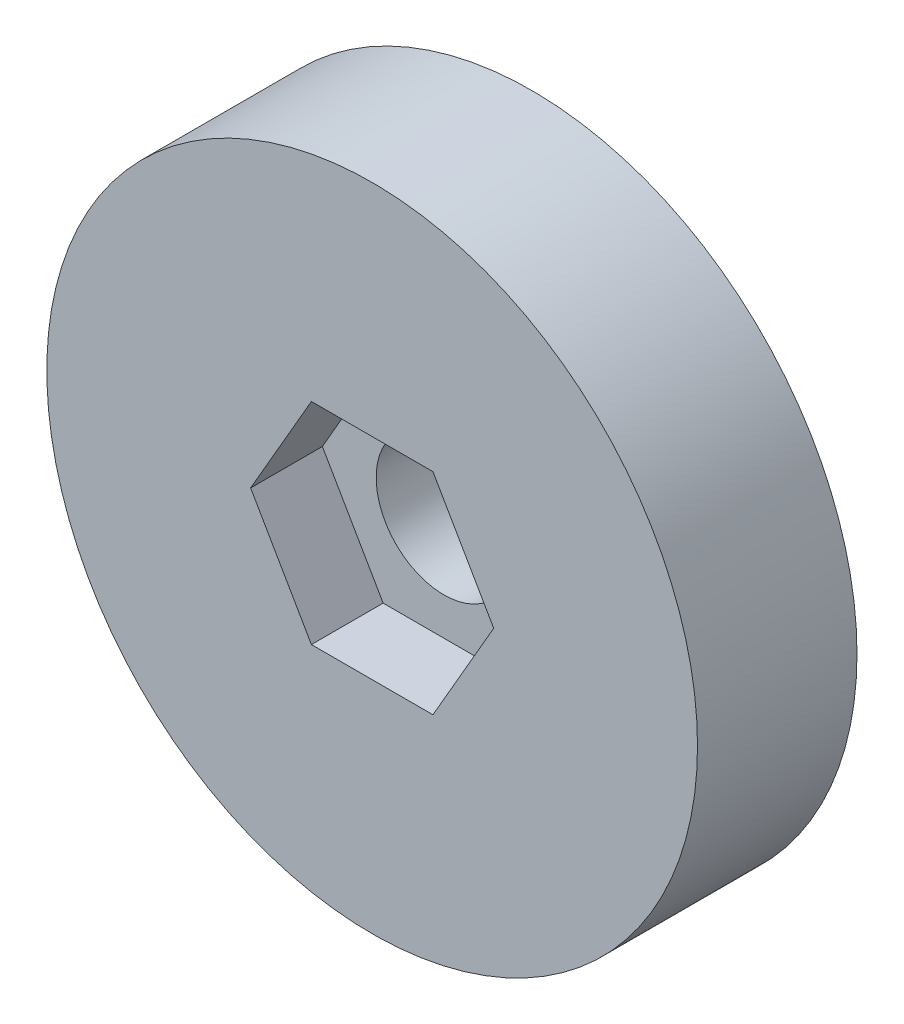
ISO-10303-21;
HEADER;
FILE_DESCRIPTION(('STEP AP214'),'2;1');
FILE_NAME('part.step','',(''),(''),'','','');
FILE_SCHEMA(('AUTOMOTIVE_DESIGN { 1 0 10303 214 1 1 1 1 }'));
ENDSEC;
DATA;
#1=APPLICATION_CONTEXT('core data for automotive mechanical design processes');
#2=APPLICATION_PROTOCOL_DEFINITION('international standard','automotive_design',2000,#1);
#3=PRODUCT_CONTEXT('',#1,'mechanical');
#4=PRODUCT('Part','Part','',(#3));
#5=PRODUCT_RELATED_PRODUCT_CATEGORY('part','',(#4));
#6=PRODUCT_DEFINITION_FORMATION('','',#4);
#7=PRODUCT_DEFINITION_CONTEXT('part definition',#1,'design');
#8=PRODUCT_DEFINITION('design','',#6,#7);
#9=PRODUCT_DEFINITION_SHAPE('','',#8);
#10=(LENGTH_UNIT() NAMED_UNIT(*) SI_UNIT(.MILLI.,.METRE.));
#11=(NAMED_UNIT(*) PLANE_ANGLE_UNIT() SI_UNIT($,.RADIAN.));
#12=(NAMED_UNIT(*) SI_UNIT($,.STERADIAN.) SOLID_ANGLE_UNIT());
#13=UNCERTAINTY_MEASURE_WITH_UNIT(LENGTH_MEASURE(1.E-05),#10,'distance_accuracy_value','');
#14=(GEOMETRIC_REPRESENTATION_CONTEXT(3) GLOBAL_UNCERTAINTY_ASSIGNED_CONTEXT((#13)) GLOBAL_UNIT_ASSIGNED_CONTEXT((#10,
#11,#12)) REPRESENTATION_CONTEXT('',''));
#15=CARTESIAN_POINT('',(0.,0.,0.));
#16=DIRECTION('',(0.,0.,1.));
#17=DIRECTION('',(1.,0.,0.));
#18=AXIS2_PLACEMENT_3D('',#15,#16,#17);
#19=CARTESIAN_POINT('',(0.,0.,10.));
#20=DIRECTION('',(0.,0.,-1.));
#21=DIRECTION('',(-1.,0.,0.));
#22=AXIS2_PLACEMENT_3D('',#19,#20,#21);
#23=CYLINDRICAL_SURFACE('',#22,4.25);
#24=CARTESIAN_POINT('',(0.,0.,0.));
#25=DIRECTION('',(0.,0.,1.));
#26=DIRECTION('',(1.,0.,0.));
#27=AXIS2_PLACEMENT_3D('',#24,#25,#26);
#28=CIRCLE('',#27,4.25);
#29=CARTESIAN_POINT('',(4.25,0.,0.));
#30=VERTEX_POINT('',#29);
#31=EDGE_CURVE('E142',#30,#30,#28,.T.);
#32=ORIENTED_EDGE('',*,*,#31,.F.);
#33=EDGE_LOOP('',(#32));
#34=FACE_BOUND('',#33,.T.);
#35=CARTESIAN_POINT('',(0.,0.,5.5));
#36=DIRECTION('',(0.,0.,1.));
#37=DIRECTION('',(1.,0.,0.));
#38=AXIS2_PLACEMENT_3D('',#35,#36,#37);
#39=CIRCLE('',#38,4.25);
#40=CARTESIAN_POINT('',(4.25,0.,5.5));
#41=VERTEX_POINT('',#40);
#42=EDGE_CURVE('E37',#41,#41,#39,.T.);
#43=ORIENTED_EDGE('',*,*,#42,.T.);
#44=EDGE_LOOP('',(#43));
#45=FACE_BOUND('',#44,.T.);
#46=ADVANCED_FACE('F33',(#34,#45),#23,.F.);
#47=CARTESIAN_POINT('',(0.,0.,10.));
#48=DIRECTION('',(0.,0.,1.));
#49=DIRECTION('',(1.,0.,0.));
#50=AXIS2_PLACEMENT_3D('',#47,#48,#49);
#51=PLANE('',#50);
#52=DIRECTION('',(1.,0.,0.));
#53=VECTOR('',#52,1.);
#54=CARTESIAN_POINT('',(-3.81051177665153,-6.6,10.));
#55=LINE('',#54,#53);
#56=CARTESIAN_POINT('',(-3.81051177665153,-6.6,10.));
#57=VERTEX_POINT('',#56);
#58=CARTESIAN_POINT('',(3.81051177665153,-6.6,10.));
#59=VERTEX_POINT('',#58);
#60=EDGE_CURVE('E50',#57,#59,#55,.T.);
#61=ORIENTED_EDGE('',*,*,#60,.F.);
#62=DIRECTION('',(0.5,-0.866025403784439,0.));
#63=VECTOR('',#62,1.);
#64=CARTESIAN_POINT('',(-7.62102355330306,0.,10.));
#65=LINE('',#64,#63);
#66=CARTESIAN_POINT('',(-7.62102355330306,0.,10.));
#67=VERTEX_POINT('',#66);
#68=EDGE_CURVE('E133',#67,#57,#65,.T.);
#69=ORIENTED_EDGE('',*,*,#68,.F.);
#70=DIRECTION('',(-0.5,-0.866025403784438,0.));
#71=VECTOR('',#70,1.);
#72=CARTESIAN_POINT('',(-3.81051177665153,6.6,10.));
#73=LINE('',#72,#71);
#74=CARTESIAN_POINT('',(-3.81051177665153,6.6,10.));
#75=VERTEX_POINT('',#74);
#76=EDGE_CURVE('E131',#75,#67,#73,.T.);
#77=ORIENTED_EDGE('',*,*,#76,.F.);
#78=DIRECTION('',(-1.,0.,0.));
#79=VECTOR('',#78,1.);
#80=CARTESIAN_POINT('',(3.81051177665153,6.6,10.));
#81=LINE('',#80,#79);
#82=CARTESIAN_POINT('',(3.81051177665153,6.6,10.));
#83=VERTEX_POINT('',#82);
#84=EDGE_CURVE('E98',#83,#75,#81,.T.);
#85=ORIENTED_EDGE('',*,*,#84,.F.);
#86=DIRECTION('',(-0.5,0.866025403784439,0.));
#87=VECTOR('',#86,1.);
#88=CARTESIAN_POINT('',(7.62102355330306,0.,10.));
#89=LINE('',#88,#87);
#90=CARTESIAN_POINT('',(7.62102355330306,0.,10.));
#91=VERTEX_POINT('',#90);
#92=EDGE_CURVE('E127',#91,#83,#89,.T.);
#93=ORIENTED_EDGE('',*,*,#92,.F.);
#94=DIRECTION('',(0.5,0.866025403784439,0.));
#95=VECTOR('',#94,1.);
#96=CARTESIAN_POINT('',(3.81051177665153,-6.6,10.));
#97=LINE('',#96,#95);
#98=EDGE_CURVE('E124',#59,#91,#97,.T.);
#99=ORIENTED_EDGE('',*,*,#98,.F.);
#100=EDGE_LOOP('',(#61,#69,#77,#85,#93,#99));
#101=FACE_BOUND('',#100,.T.);
#102=CARTESIAN_POINT('',(0.,0.,10.));
#103=DIRECTION('',(0.,0.,1.));
#104=DIRECTION('',(1.,0.,0.));
#105=AXIS2_PLACEMENT_3D('',#102,#103,#104);
#106=CIRCLE('',#105,20.4);
#107=CARTESIAN_POINT('',(20.4,0.,10.));
#108=VERTEX_POINT('',#107);
#109=EDGE_CURVE('E11',#108,#108,#106,.T.);
#110=ORIENTED_EDGE('',*,*,#109,.T.);
#111=EDGE_LOOP('',(#110));
#112=FACE_BOUND('',#111,.T.);
#113=ADVANCED_FACE('F151',(#101,#112),#51,.T.);
#114=CARTESIAN_POINT('',(0.,0.,0.));
#115=DIRECTION('',(0.,0.,1.));
#116=DIRECTION('',(1.,0.,0.));
#117=AXIS2_PLACEMENT_3D('',#114,#115,#116);
#118=PLANE('',#117);
#119=CARTESIAN_POINT('',(0.,0.,0.));
#120=DIRECTION('',(0.,0.,1.));
#121=DIRECTION('',(1.,0.,0.));
#122=AXIS2_PLACEMENT_3D('',#119,#120,#121);
#123=CIRCLE('',#122,20.4);
#124=CARTESIAN_POINT('',(20.4,0.,0.));
#125=VERTEX_POINT('',#124);
#126=EDGE_CURVE('E42',#125,#125,#123,.T.);
#127=ORIENTED_EDGE('',*,*,#126,.F.);
#128=EDGE_LOOP('',(#127));
#129=FACE_BOUND('',#128,.T.);
#130=ORIENTED_EDGE('',*,*,#31,.T.);
#131=EDGE_LOOP('',(#130));
#132=FACE_BOUND('',#131,.T.);
#133=ADVANCED_FACE('F148',(#129,#132),#118,.F.);
#134=CARTESIAN_POINT('',(0.,0.,10.));
#135=DIRECTION('',(0.,0.,-1.));
#136=DIRECTION('',(-1.,0.,0.));
#137=AXIS2_PLACEMENT_3D('',#134,#135,#136);
#138=CYLINDRICAL_SURFACE('',#137,20.4);
#139=ORIENTED_EDGE('',*,*,#109,.F.);
#140=EDGE_LOOP('',(#139));
#141=FACE_BOUND('',#140,.T.);
#142=ORIENTED_EDGE('',*,*,#126,.T.);
#143=EDGE_LOOP('',(#142));
#144=FACE_BOUND('',#143,.T.);
#145=ADVANCED_FACE('F35',(#141,#144),#138,.T.);
#146=CARTESIAN_POINT('',(-3.81051177665153,-6.6,5.5));
#147=DIRECTION('',(0.,-1.,0.));
#148=DIRECTION('',(1.,0.,0.));
#149=AXIS2_PLACEMENT_3D('',#146,#147,#148);
#150=PLANE('',#149);
#151=ORIENTED_EDGE('',*,*,#60,.T.);
#152=DIRECTION('',(0.,0.,1.));
#153=VECTOR('',#152,1.);
#154=CARTESIAN_POINT('',(3.81051177665153,-6.6,5.5));
#155=LINE('',#154,#153);
#156=CARTESIAN_POINT('',(3.81051177665153,-6.6,5.5));
#157=VERTEX_POINT('',#156);
#158=EDGE_CURVE('E80',#157,#59,#155,.T.);
#159=ORIENTED_EDGE('',*,*,#158,.F.);
#160=DIRECTION('',(1.,0.,0.));
#161=VECTOR('',#160,1.);
#162=CARTESIAN_POINT('',(-3.81051177665153,-6.6,5.5));
#163=LINE('',#162,#161);
#164=CARTESIAN_POINT('',(-3.81051177665153,-6.6,5.5));
#165=VERTEX_POINT('',#164);
#166=EDGE_CURVE('E135',#165,#157,#163,.T.);
#167=ORIENTED_EDGE('',*,*,#166,.F.);
#168=DIRECTION('',(0.,0.,1.));
#169=VECTOR('',#168,1.);
#170=CARTESIAN_POINT('',(-3.81051177665153,-6.6,5.5));
#171=LINE('',#170,#169);
#172=EDGE_CURVE('E58',#165,#57,#171,.T.);
#173=ORIENTED_EDGE('',*,*,#172,.T.);
#174=EDGE_LOOP('',(#151,#159,#167,#173));
#175=FACE_BOUND('',#174,.T.);
#176=ADVANCED_FACE('F173',(#175),#150,.F.);
#177=CARTESIAN_POINT('',(-7.62102355330306,0.,5.5));
#178=DIRECTION('',(-0.866025403784439,-0.5,0.));
#179=DIRECTION('',(0.5,-0.866025403784439,0.));
#180=AXIS2_PLACEMENT_3D('',#177,#178,#179);
#181=PLANE('',#180);
#182=ORIENTED_EDGE('',*,*,#68,.T.);
#183=ORIENTED_EDGE('',*,*,#172,.F.);
#184=DIRECTION('',(0.5,-0.866025403784439,0.));
#185=VECTOR('',#184,1.);
#186=CARTESIAN_POINT('',(-7.62102355330306,0.,5.5));
#187=LINE('',#186,#185);
#188=CARTESIAN_POINT('',(-7.62102355330306,0.,5.5));
#189=VERTEX_POINT('',#188);
#190=EDGE_CURVE('E110',#189,#165,#187,.T.);
#191=ORIENTED_EDGE('',*,*,#190,.F.);
#192=DIRECTION('',(0.,0.,1.));
#193=VECTOR('',#192,1.);
#194=CARTESIAN_POINT('',(-7.62102355330306,0.,5.5));
#195=LINE('',#194,#193);
#196=EDGE_CURVE('E102',#189,#67,#195,.T.);
#197=ORIENTED_EDGE('',*,*,#196,.T.);
#198=EDGE_LOOP('',(#182,#183,#191,#197));
#199=FACE_BOUND('',#198,.T.);
#200=ADVANCED_FACE('F170',(#199),#181,.F.);
#201=CARTESIAN_POINT('',(-3.81051177665153,6.6,5.5));
#202=DIRECTION('',(-0.866025403784439,0.5,0.));
#203=DIRECTION('',(-0.5,-0.866025403784439,0.));
#204=AXIS2_PLACEMENT_3D('',#201,#202,#203);
#205=PLANE('',#204);
#206=ORIENTED_EDGE('',*,*,#76,.T.);
#207=ORIENTED_EDGE('',*,*,#196,.F.);
#208=DIRECTION('',(-0.5,-0.866025403784438,0.));
#209=VECTOR('',#208,1.);
#210=CARTESIAN_POINT('',(-3.81051177665153,6.6,5.5));
#211=LINE('',#210,#209);
#212=CARTESIAN_POINT('',(-3.81051177665153,6.6,5.5));
#213=VERTEX_POINT('',#212);
#214=EDGE_CURVE('E106',#213,#189,#211,.T.);
#215=ORIENTED_EDGE('',*,*,#214,.F.);
#216=DIRECTION('',(0.,0.,1.));
#217=VECTOR('',#216,1.);
#218=CARTESIAN_POINT('',(-3.81051177665153,6.6,5.5));
#219=LINE('',#218,#217);
#220=EDGE_CURVE('E91',#213,#75,#219,.T.);
#221=ORIENTED_EDGE('',*,*,#220,.T.);
#222=EDGE_LOOP('',(#206,#207,#215,#221));
#223=FACE_BOUND('',#222,.T.);
#224=ADVANCED_FACE('F107',(#223),#205,.F.);
#225=CARTESIAN_POINT('',(3.81051177665153,6.6,5.5));
#226=DIRECTION('',(0.,1.,0.));
#227=DIRECTION('',(0.,0.,1.));
#228=AXIS2_PLACEMENT_3D('',#225,#226,#227);
#229=PLANE('',#228);
#230=ORIENTED_EDGE('',*,*,#84,.T.);
#231=ORIENTED_EDGE('',*,*,#220,.F.);
#232=DIRECTION('',(-1.,0.,0.));
#233=VECTOR('',#232,1.);
#234=CARTESIAN_POINT('',(3.81051177665153,6.6,5.5));
#235=LINE('',#234,#233);
#236=CARTESIAN_POINT('',(3.81051177665153,6.6,5.5));
#237=VERTEX_POINT('',#236);
#238=EDGE_CURVE('E95',#237,#213,#235,.T.);
#239=ORIENTED_EDGE('',*,*,#238,.F.);
#240=DIRECTION('',(0.,0.,1.));
#241=VECTOR('',#240,1.);
#242=CARTESIAN_POINT('',(3.81051177665153,6.6,5.5));
#243=LINE('',#242,#241);
#244=EDGE_CURVE('E103',#237,#83,#243,.T.);
#245=ORIENTED_EDGE('',*,*,#244,.T.);
#246=EDGE_LOOP('',(#230,#231,#239,#245));
#247=FACE_BOUND('',#246,.T.);
#248=ADVANCED_FACE('F93',(#247),#229,.F.);
#249=CARTESIAN_POINT('',(7.62102355330306,0.,5.5));
#250=DIRECTION('',(0.866025403784439,0.5,0.));
#251=DIRECTION('',(-0.5,0.866025403784439,0.));
#252=AXIS2_PLACEMENT_3D('',#249,#250,#251);
#253=PLANE('',#252);
#254=ORIENTED_EDGE('',*,*,#92,.T.);
#255=ORIENTED_EDGE('',*,*,#244,.F.);
#256=DIRECTION('',(-0.5,0.866025403784439,0.));
#257=VECTOR('',#256,1.);
#258=CARTESIAN_POINT('',(7.62102355330306,0.,5.5));
#259=LINE('',#258,#257);
#260=CARTESIAN_POINT('',(7.62102355330306,0.,5.5));
#261=VERTEX_POINT('',#260);
#262=EDGE_CURVE('E116',#261,#237,#259,.T.);
#263=ORIENTED_EDGE('',*,*,#262,.F.);
#264=DIRECTION('',(0.,0.,1.));
#265=VECTOR('',#264,1.);
#266=CARTESIAN_POINT('',(7.62102355330306,0.,5.5));
#267=LINE('',#266,#265);
#268=EDGE_CURVE('E139',#261,#91,#267,.T.);
#269=ORIENTED_EDGE('',*,*,#268,.T.);
#270=EDGE_LOOP('',(#254,#255,#263,#269));
#271=FACE_BOUND('',#270,.T.);
#272=ADVANCED_FACE('F166',(#271),#253,.F.);
#273=CARTESIAN_POINT('',(3.81051177665153,-6.6,5.5));
#274=DIRECTION('',(0.866025403784439,-0.5,0.));
#275=DIRECTION('',(0.5,0.866025403784439,0.));
#276=AXIS2_PLACEMENT_3D('',#273,#274,#275);
#277=PLANE('',#276);
#278=ORIENTED_EDGE('',*,*,#98,.T.);
#279=ORIENTED_EDGE('',*,*,#268,.F.);
#280=DIRECTION('',(0.5,0.866025403784439,0.));
#281=VECTOR('',#280,1.);
#282=CARTESIAN_POINT('',(3.81051177665153,-6.6,5.5));
#283=LINE('',#282,#281);
#284=EDGE_CURVE('E118',#157,#261,#283,.T.);
#285=ORIENTED_EDGE('',*,*,#284,.F.);
#286=ORIENTED_EDGE('',*,*,#158,.T.);
#287=EDGE_LOOP('',(#278,#279,#285,#286));
#288=FACE_BOUND('',#287,.T.);
#289=ADVANCED_FACE('F161',(#288),#277,.F.);
#290=CARTESIAN_POINT('',(0.,0.,5.5));
#291=DIRECTION('',(0.,0.,1.));
#292=DIRECTION('',(1.,0.,0.));
#293=AXIS2_PLACEMENT_3D('',#290,#291,#292);
#294=PLANE('',#293);
#295=ORIENTED_EDGE('',*,*,#42,.F.);
#296=EDGE_LOOP('',(#295));
#297=FACE_BOUND('',#296,.T.);
#298=ORIENTED_EDGE('',*,*,#166,.T.);
#299=ORIENTED_EDGE('',*,*,#284,.T.);
#300=ORIENTED_EDGE('',*,*,#262,.T.);
#301=ORIENTED_EDGE('',*,*,#238,.T.);
#302=ORIENTED_EDGE('',*,*,#214,.T.);
#303=ORIENTED_EDGE('',*,*,#190,.T.);
#304=EDGE_LOOP('',(#298,#299,#300,#301,#302,#303));
#305=FACE_BOUND('',#304,.T.);
#306=ADVANCED_FACE('F113',(#297,#305),#294,.T.);
#307=CLOSED_SHELL('',(#46,#113,#133,#145,#176,#200,#224,#248,#272,#289,#306));
#308=MANIFOLD_SOLID_BREP('B2',#307);
#309=ADVANCED_BREP_SHAPE_REPRESENTATION('',(#18,#308),#14);
#310=SHAPE_DEFINITION_REPRESENTATION(#9,#309);
ENDSEC;
END-ISO-10303-21;
